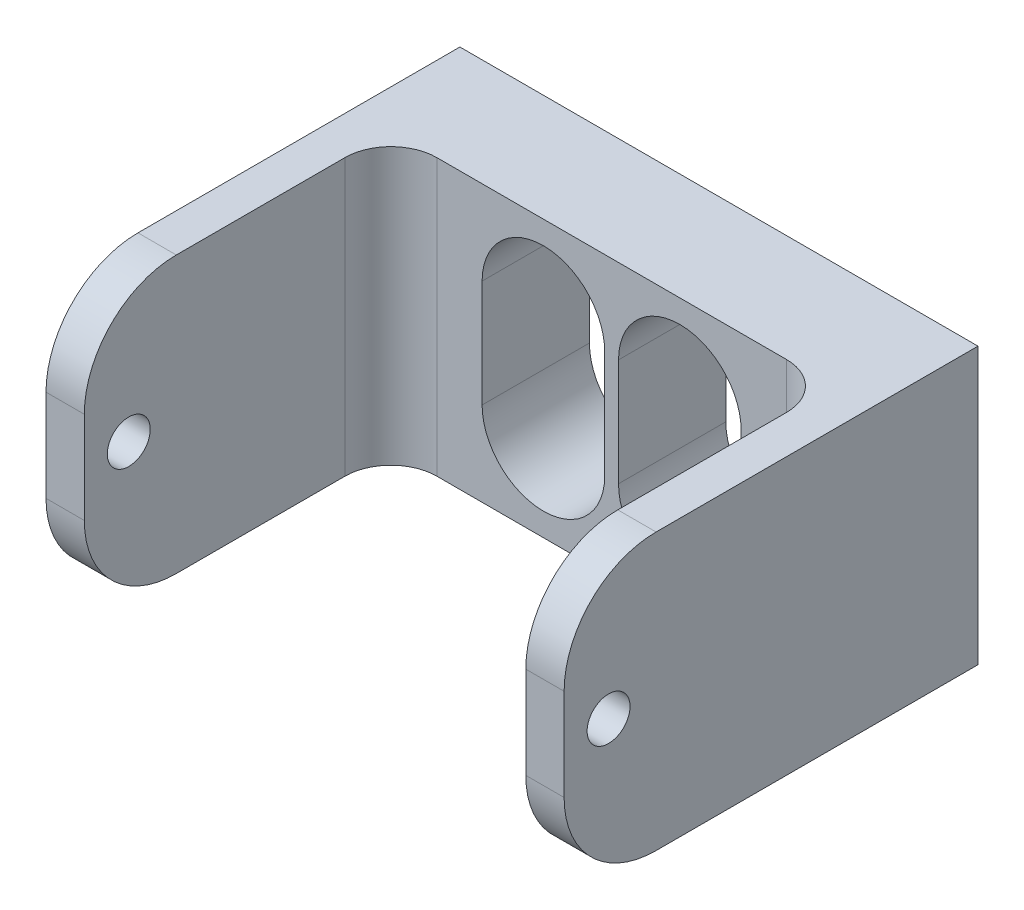
ISO-10303-21;
HEADER;
FILE_DESCRIPTION(('STEP AP214'),'2;1');
FILE_NAME('part.step','',(''),(''),'','','');
FILE_SCHEMA(('AUTOMOTIVE_DESIGN { 1 0 10303 214 1 1 1 1 }'));
ENDSEC;
DATA;
#1=APPLICATION_CONTEXT('core data for automotive mechanical design processes');
#2=APPLICATION_PROTOCOL_DEFINITION('international standard','automotive_design',2000,#1);
#3=PRODUCT_CONTEXT('',#1,'mechanical');
#4=PRODUCT('Part','Part','',(#3));
#5=PRODUCT_RELATED_PRODUCT_CATEGORY('part','',(#4));
#6=PRODUCT_DEFINITION_FORMATION('','',#4);
#7=PRODUCT_DEFINITION_CONTEXT('part definition',#1,'design');
#8=PRODUCT_DEFINITION('design','',#6,#7);
#9=PRODUCT_DEFINITION_SHAPE('','',#8);
#10=(LENGTH_UNIT() NAMED_UNIT(*) SI_UNIT(.MILLI.,.METRE.));
#11=(NAMED_UNIT(*) PLANE_ANGLE_UNIT() SI_UNIT($,.RADIAN.));
#12=(NAMED_UNIT(*) SI_UNIT($,.STERADIAN.) SOLID_ANGLE_UNIT());
#13=UNCERTAINTY_MEASURE_WITH_UNIT(LENGTH_MEASURE(1.E-05),#10,'distance_accuracy_value','');
#14=(GEOMETRIC_REPRESENTATION_CONTEXT(3) GLOBAL_UNCERTAINTY_ASSIGNED_CONTEXT((#13)) GLOBAL_UNIT_ASSIGNED_CONTEXT((#10,
#11,#12)) REPRESENTATION_CONTEXT('',''));
#15=CARTESIAN_POINT('',(0.,0.,0.));
#16=DIRECTION('',(0.,0.,1.));
#17=DIRECTION('',(1.,0.,0.));
#18=AXIS2_PLACEMENT_3D('',#15,#16,#17);
#19=CARTESIAN_POINT('',(0.,0.,7.));
#20=DIRECTION('',(0.,0.,-1.));
#21=DIRECTION('',(-1.,0.,0.));
#22=AXIS2_PLACEMENT_3D('',#19,#20,#21);
#23=PLANE('',#22);
#24=CARTESIAN_POINT('',(-4.45,3.50000000000001,7.));
#25=DIRECTION('',(0.,0.,1.));
#26=DIRECTION('',(1.,0.,0.));
#27=AXIS2_PLACEMENT_3D('',#24,#25,#26);
#28=CIRCLE('',#27,4.);
#29=CARTESIAN_POINT('',(-0.449999999999998,3.50000000000001,7.));
#30=VERTEX_POINT('',#29);
#31=CARTESIAN_POINT('',(-8.45,3.50000000000001,7.));
#32=VERTEX_POINT('',#31);
#33=EDGE_CURVE('E229',#30,#32,#28,.T.);
#34=ORIENTED_EDGE('',*,*,#33,.F.);
#35=DIRECTION('',(0.,1.,0.));
#36=VECTOR('',#35,1.);
#37=CARTESIAN_POINT('',(-0.449999999999998,3.50000000000001,7.));
#38=LINE('',#37,#36);
#39=CARTESIAN_POINT('',(-0.449999999999995,-3.49999999999999,7.));
#40=VERTEX_POINT('',#39);
#41=EDGE_CURVE('E237',#40,#30,#38,.T.);
#42=ORIENTED_EDGE('',*,*,#41,.F.);
#43=CARTESIAN_POINT('',(-4.45,-3.49999999999999,7.));
#44=DIRECTION('',(0.,0.,1.));
#45=DIRECTION('',(1.,0.,0.));
#46=AXIS2_PLACEMENT_3D('',#43,#44,#45);
#47=CIRCLE('',#46,4.);
#48=CARTESIAN_POINT('',(-8.45,-3.49999999999999,7.));
#49=VERTEX_POINT('',#48);
#50=EDGE_CURVE('E234',#49,#40,#47,.T.);
#51=ORIENTED_EDGE('',*,*,#50,.F.);
#52=DIRECTION('',(0.,-1.,0.));
#53=VECTOR('',#52,1.);
#54=CARTESIAN_POINT('',(-8.45,3.50000000000001,7.));
#55=LINE('',#54,#53);
#56=EDGE_CURVE('E231',#32,#49,#55,.T.);
#57=ORIENTED_EDGE('',*,*,#56,.F.);
#58=EDGE_LOOP('',(#34,#42,#51,#57));
#59=FACE_BOUND('',#58,.T.);
#60=CARTESIAN_POINT('',(4.45,3.5,7.));
#61=DIRECTION('',(0.,0.,1.));
#62=DIRECTION('',(1.,0.,0.));
#63=AXIS2_PLACEMENT_3D('',#60,#61,#62);
#64=CIRCLE('',#63,4.);
#65=CARTESIAN_POINT('',(8.45,3.5,7.));
#66=VERTEX_POINT('',#65);
#67=CARTESIAN_POINT('',(0.449999999999999,3.5,7.));
#68=VERTEX_POINT('',#67);
#69=EDGE_CURVE('E185',#66,#68,#64,.T.);
#70=ORIENTED_EDGE('',*,*,#69,.F.);
#71=DIRECTION('',(0.,1.,0.));
#72=VECTOR('',#71,1.);
#73=CARTESIAN_POINT('',(8.45,3.5,7.));
#74=LINE('',#73,#72);
#75=CARTESIAN_POINT('',(8.45,-3.5,7.));
#76=VERTEX_POINT('',#75);
#77=EDGE_CURVE('E211',#76,#66,#74,.T.);
#78=ORIENTED_EDGE('',*,*,#77,.F.);
#79=CARTESIAN_POINT('',(4.45,-3.5,7.));
#80=DIRECTION('',(0.,0.,1.));
#81=DIRECTION('',(1.,0.,0.));
#82=AXIS2_PLACEMENT_3D('',#79,#80,#81);
#83=CIRCLE('',#82,4.);
#84=CARTESIAN_POINT('',(0.45,-3.5,7.));
#85=VERTEX_POINT('',#84);
#86=EDGE_CURVE('E209',#85,#76,#83,.T.);
#87=ORIENTED_EDGE('',*,*,#86,.F.);
#88=DIRECTION('',(0.,-1.,0.));
#89=VECTOR('',#88,1.);
#90=CARTESIAN_POINT('',(0.449999999999999,3.5,7.));
#91=LINE('',#90,#89);
#92=EDGE_CURVE('E195',#68,#85,#91,.T.);
#93=ORIENTED_EDGE('',*,*,#92,.F.);
#94=EDGE_LOOP('',(#70,#78,#87,#93));
#95=FACE_BOUND('',#94,.T.);
#96=DIRECTION('',(1.,0.,0.));
#97=VECTOR('',#96,1.);
#98=CARTESIAN_POINT('',(-16.9,-9.,7.));
#99=LINE('',#98,#97);
#100=CARTESIAN_POINT('',(-11.4,-9.,7.));
#101=VERTEX_POINT('',#100);
#102=CARTESIAN_POINT('',(11.4,-9.,7.));
#103=VERTEX_POINT('',#102);
#104=EDGE_CURVE('E269',#101,#103,#99,.T.);
#105=ORIENTED_EDGE('',*,*,#104,.T.);
#106=DIRECTION('',(0.,-1.,0.));
#107=VECTOR('',#106,1.);
#108=CARTESIAN_POINT('',(11.4,9.,7.));
#109=LINE('',#108,#107);
#110=CARTESIAN_POINT('',(11.4,9.,7.));
#111=VERTEX_POINT('',#110);
#112=EDGE_CURVE('E278',#103,#111,#109,.F.);
#113=ORIENTED_EDGE('',*,*,#112,.T.);
#114=DIRECTION('',(-1.,0.,0.));
#115=VECTOR('',#114,1.);
#116=CARTESIAN_POINT('',(-16.9,9.,7.));
#117=LINE('',#116,#115);
#118=CARTESIAN_POINT('',(-11.4,9.,7.));
#119=VERTEX_POINT('',#118);
#120=EDGE_CURVE('E265',#111,#119,#117,.T.);
#121=ORIENTED_EDGE('',*,*,#120,.T.);
#122=DIRECTION('',(0.,1.,0.));
#123=VECTOR('',#122,1.);
#124=CARTESIAN_POINT('',(-11.4,-9.,7.));
#125=LINE('',#124,#123);
#126=EDGE_CURVE('E276',#119,#101,#125,.F.);
#127=ORIENTED_EDGE('',*,*,#126,.T.);
#128=EDGE_LOOP('',(#105,#113,#121,#127));
#129=FACE_BOUND('',#128,.T.);
#130=ADVANCED_FACE('F35',(#59,#95,#129),#23,.F.);
#131=CARTESIAN_POINT('',(0.,0.,0.));
#132=DIRECTION('',(0.,0.,-1.));
#133=DIRECTION('',(-1.,0.,0.));
#134=AXIS2_PLACEMENT_3D('',#131,#132,#133);
#135=PLANE('',#134);
#136=DIRECTION('',(0.,1.,0.));
#137=VECTOR('',#136,1.);
#138=CARTESIAN_POINT('',(-0.449999999999998,3.50000000000001,0.));
#139=LINE('',#138,#137);
#140=CARTESIAN_POINT('',(-0.449999999999995,-3.49999999999999,0.));
#141=VERTEX_POINT('',#140);
#142=CARTESIAN_POINT('',(-0.449999999999998,3.50000000000001,0.));
#143=VERTEX_POINT('',#142);
#144=EDGE_CURVE('E232',#141,#143,#139,.T.);
#145=ORIENTED_EDGE('',*,*,#144,.T.);
#146=CARTESIAN_POINT('',(-4.45,3.50000000000001,0.));
#147=DIRECTION('',(0.,0.,1.));
#148=DIRECTION('',(1.,0.,0.));
#149=AXIS2_PLACEMENT_3D('',#146,#147,#148);
#150=CIRCLE('',#149,4.);
#151=CARTESIAN_POINT('',(-8.45,3.50000000000001,0.));
#152=VERTEX_POINT('',#151);
#153=EDGE_CURVE('E203',#143,#152,#150,.T.);
#154=ORIENTED_EDGE('',*,*,#153,.T.);
#155=DIRECTION('',(0.,-1.,0.));
#156=VECTOR('',#155,1.);
#157=CARTESIAN_POINT('',(-8.45,3.50000000000001,0.));
#158=LINE('',#157,#156);
#159=CARTESIAN_POINT('',(-8.45,-3.49999999999999,0.));
#160=VERTEX_POINT('',#159);
#161=EDGE_CURVE('E242',#152,#160,#158,.T.);
#162=ORIENTED_EDGE('',*,*,#161,.T.);
#163=CARTESIAN_POINT('',(-4.45,-3.49999999999999,0.));
#164=DIRECTION('',(0.,0.,1.));
#165=DIRECTION('',(1.,0.,0.));
#166=AXIS2_PLACEMENT_3D('',#163,#164,#165);
#167=CIRCLE('',#166,4.);
#168=EDGE_CURVE('E245',#160,#141,#167,.T.);
#169=ORIENTED_EDGE('',*,*,#168,.T.);
#170=EDGE_LOOP('',(#145,#154,#162,#169));
#171=FACE_BOUND('',#170,.T.);
#172=DIRECTION('',(0.,1.,0.));
#173=VECTOR('',#172,1.);
#174=CARTESIAN_POINT('',(16.9,-9.,0.));
#175=LINE('',#174,#173);
#176=CARTESIAN_POINT('',(16.9,-9.,0.));
#177=VERTEX_POINT('',#176);
#178=CARTESIAN_POINT('',(16.9,9.,0.));
#179=VERTEX_POINT('',#178);
#180=EDGE_CURVE('E259',#177,#179,#175,.T.);
#181=ORIENTED_EDGE('',*,*,#180,.F.);
#182=DIRECTION('',(1.,0.,0.));
#183=VECTOR('',#182,1.);
#184=CARTESIAN_POINT('',(-16.9,-9.,0.));
#185=LINE('',#184,#183);
#186=CARTESIAN_POINT('',(-16.9,-9.,0.));
#187=VERTEX_POINT('',#186);
#188=EDGE_CURVE('E270',#187,#177,#185,.T.);
#189=ORIENTED_EDGE('',*,*,#188,.F.);
#190=DIRECTION('',(0.,-1.,0.));
#191=VECTOR('',#190,1.);
#192=CARTESIAN_POINT('',(-16.9,-9.,0.));
#193=LINE('',#192,#191);
#194=CARTESIAN_POINT('',(-16.9,9.,0.));
#195=VERTEX_POINT('',#194);
#196=EDGE_CURVE('E403',#195,#187,#193,.T.);
#197=ORIENTED_EDGE('',*,*,#196,.F.);
#198=DIRECTION('',(-1.,0.,0.));
#199=VECTOR('',#198,1.);
#200=CARTESIAN_POINT('',(-16.9,9.,0.));
#201=LINE('',#200,#199);
#202=EDGE_CURVE('E394',#179,#195,#201,.T.);
#203=ORIENTED_EDGE('',*,*,#202,.F.);
#204=EDGE_LOOP('',(#181,#189,#197,#203));
#205=FACE_BOUND('',#204,.T.);
#206=DIRECTION('',(0.,1.,0.));
#207=VECTOR('',#206,1.);
#208=CARTESIAN_POINT('',(8.45,3.5,0.));
#209=LINE('',#208,#207);
#210=CARTESIAN_POINT('',(8.45,-3.5,0.));
#211=VERTEX_POINT('',#210);
#212=CARTESIAN_POINT('',(8.45,3.5,0.));
#213=VERTEX_POINT('',#212);
#214=EDGE_CURVE('E196',#211,#213,#209,.T.);
#215=ORIENTED_EDGE('',*,*,#214,.T.);
#216=CARTESIAN_POINT('',(4.45,3.5,0.));
#217=DIRECTION('',(0.,0.,1.));
#218=DIRECTION('',(1.,0.,0.));
#219=AXIS2_PLACEMENT_3D('',#216,#217,#218);
#220=CIRCLE('',#219,4.);
#221=CARTESIAN_POINT('',(0.449999999999999,3.5,0.));
#222=VERTEX_POINT('',#221);
#223=EDGE_CURVE('E216',#213,#222,#220,.T.);
#224=ORIENTED_EDGE('',*,*,#223,.T.);
#225=DIRECTION('',(0.,-1.,0.));
#226=VECTOR('',#225,1.);
#227=CARTESIAN_POINT('',(0.449999999999999,3.5,0.));
#228=LINE('',#227,#226);
#229=CARTESIAN_POINT('',(0.45,-3.5,0.));
#230=VERTEX_POINT('',#229);
#231=EDGE_CURVE('E202',#222,#230,#228,.T.);
#232=ORIENTED_EDGE('',*,*,#231,.T.);
#233=CARTESIAN_POINT('',(4.45,-3.5,0.));
#234=DIRECTION('',(0.,0.,1.));
#235=DIRECTION('',(1.,0.,0.));
#236=AXIS2_PLACEMENT_3D('',#233,#234,#235);
#237=CIRCLE('',#236,4.);
#238=EDGE_CURVE('E220',#230,#211,#237,.T.);
#239=ORIENTED_EDGE('',*,*,#238,.T.);
#240=EDGE_LOOP('',(#215,#224,#232,#239));
#241=FACE_BOUND('',#240,.T.);
#242=ADVANCED_FACE('F410',(#171,#205,#241),#135,.T.);
#243=CARTESIAN_POINT('',(16.9,-9.,7.));
#244=DIRECTION('',(-1.,0.,0.));
#245=DIRECTION('',(0.,0.,1.));
#246=AXIS2_PLACEMENT_3D('',#243,#244,#245);
#247=PLANE('',#246);
#248=CARTESIAN_POINT('',(16.9,0.,24.1));
#249=DIRECTION('',(1.,0.,0.));
#250=DIRECTION('',(0.,0.,-1.));
#251=AXIS2_PLACEMENT_3D('',#248,#249,#250);
#252=CIRCLE('',#251,1.4);
#253=CARTESIAN_POINT('',(16.9,0.,22.7));
#254=VERTEX_POINT('',#253);
#255=EDGE_CURVE('E453',#254,#254,#252,.T.);
#256=ORIENTED_EDGE('',*,*,#255,.F.);
#257=EDGE_LOOP('',(#256));
#258=FACE_BOUND('',#257,.T.);
#259=DIRECTION('',(0.,1.,0.));
#260=VECTOR('',#259,1.);
#261=CARTESIAN_POINT('',(16.9,9.,27.));
#262=LINE('',#261,#260);
#263=CARTESIAN_POINT('',(16.9,-3.,27.));
#264=VERTEX_POINT('',#263);
#265=CARTESIAN_POINT('',(16.9,3.,27.));
#266=VERTEX_POINT('',#265);
#267=EDGE_CURVE('E375',#264,#266,#262,.T.);
#268=ORIENTED_EDGE('',*,*,#267,.F.);
#269=CARTESIAN_POINT('',(16.9,-3.,21.));
#270=DIRECTION('',(-1.,0.,0.));
#271=DIRECTION('',(0.,0.,1.));
#272=AXIS2_PLACEMENT_3D('',#269,#270,#271);
#273=CIRCLE('',#272,6.);
#274=CARTESIAN_POINT('',(16.9,-9.,21.));
#275=VERTEX_POINT('',#274);
#276=EDGE_CURVE('E306',#264,#275,#273,.F.);
#277=ORIENTED_EDGE('',*,*,#276,.T.);
#278=DIRECTION('',(0.,0.,-1.));
#279=VECTOR('',#278,1.);
#280=CARTESIAN_POINT('',(16.9,-9.,7.));
#281=LINE('',#280,#279);
#282=EDGE_CURVE('E275',#275,#177,#281,.T.);
#283=ORIENTED_EDGE('',*,*,#282,.T.);
#284=ORIENTED_EDGE('',*,*,#180,.T.);
#285=DIRECTION('',(0.,0.,-1.));
#286=VECTOR('',#285,1.);
#287=CARTESIAN_POINT('',(16.9,9.,7.));
#288=LINE('',#287,#286);
#289=CARTESIAN_POINT('',(16.9,9.,21.));
#290=VERTEX_POINT('',#289);
#291=EDGE_CURVE('E324',#290,#179,#288,.T.);
#292=ORIENTED_EDGE('',*,*,#291,.F.);
#293=CARTESIAN_POINT('',(16.9,3.,21.));
#294=DIRECTION('',(-1.,0.,0.));
#295=DIRECTION('',(0.,0.,1.));
#296=AXIS2_PLACEMENT_3D('',#293,#294,#295);
#297=CIRCLE('',#296,6.);
#298=EDGE_CURVE('E326',#290,#266,#297,.F.);
#299=ORIENTED_EDGE('',*,*,#298,.T.);
#300=EDGE_LOOP('',(#268,#277,#283,#284,#292,#299));
#301=FACE_BOUND('',#300,.T.);
#302=ADVANCED_FACE('F407',(#258,#301),#247,.F.);
#303=CARTESIAN_POINT('',(-16.9,9.,7.));
#304=DIRECTION('',(0.,-1.,0.));
#305=DIRECTION('',(0.,0.,-1.));
#306=AXIS2_PLACEMENT_3D('',#303,#304,#305);
#307=PLANE('',#306);
#308=DIRECTION('',(0.,0.,-1.));
#309=VECTOR('',#308,1.);
#310=CARTESIAN_POINT('',(-16.9,9.,7.));
#311=LINE('',#310,#309);
#312=CARTESIAN_POINT('',(-16.9,9.,21.));
#313=VERTEX_POINT('',#312);
#314=EDGE_CURVE('E391',#313,#195,#311,.T.);
#315=ORIENTED_EDGE('',*,*,#314,.F.);
#316=DIRECTION('',(-1.,0.,0.));
#317=VECTOR('',#316,1.);
#318=CARTESIAN_POINT('',(-14.4,9.,21.));
#319=LINE('',#318,#317);
#320=CARTESIAN_POINT('',(-14.4,9.,21.));
#321=VERTEX_POINT('',#320);
#322=EDGE_CURVE('E357',#313,#321,#319,.F.);
#323=ORIENTED_EDGE('',*,*,#322,.T.);
#324=DIRECTION('',(0.,0.,-1.));
#325=VECTOR('',#324,1.);
#326=CARTESIAN_POINT('',(-14.4,9.,27.));
#327=LINE('',#326,#325);
#328=CARTESIAN_POINT('',(-14.4,9.,10.));
#329=VERTEX_POINT('',#328);
#330=EDGE_CURVE('E292',#321,#329,#327,.T.);
#331=ORIENTED_EDGE('',*,*,#330,.T.);
#332=CARTESIAN_POINT('',(-11.4,9.,10.));
#333=DIRECTION('',(0.,-1.,0.));
#334=DIRECTION('',(0.,0.,-1.));
#335=AXIS2_PLACEMENT_3D('',#332,#333,#334);
#336=CIRCLE('',#335,3.);
#337=EDGE_CURVE('E43',#329,#119,#336,.T.);
#338=ORIENTED_EDGE('',*,*,#337,.T.);
#339=ORIENTED_EDGE('',*,*,#120,.F.);
#340=CARTESIAN_POINT('',(11.4,9.,10.));
#341=DIRECTION('',(0.,-1.,0.));
#342=DIRECTION('',(0.,0.,-1.));
#343=AXIS2_PLACEMENT_3D('',#340,#341,#342);
#344=CIRCLE('',#343,3.);
#345=CARTESIAN_POINT('',(14.4,9.,10.));
#346=VERTEX_POINT('',#345);
#347=EDGE_CURVE('E284',#111,#346,#344,.T.);
#348=ORIENTED_EDGE('',*,*,#347,.T.);
#349=DIRECTION('',(0.,0.,-1.));
#350=VECTOR('',#349,1.);
#351=CARTESIAN_POINT('',(14.4,9.,27.));
#352=LINE('',#351,#350);
#353=CARTESIAN_POINT('',(14.4,9.,21.));
#354=VERTEX_POINT('',#353);
#355=EDGE_CURVE('E367',#354,#346,#352,.T.);
#356=ORIENTED_EDGE('',*,*,#355,.F.);
#357=DIRECTION('',(-1.,0.,0.));
#358=VECTOR('',#357,1.);
#359=CARTESIAN_POINT('',(-16.9,9.,21.));
#360=LINE('',#359,#358);
#361=EDGE_CURVE('E356',#354,#290,#360,.F.);
#362=ORIENTED_EDGE('',*,*,#361,.T.);
#363=ORIENTED_EDGE('',*,*,#291,.T.);
#364=ORIENTED_EDGE('',*,*,#202,.T.);
#365=EDGE_LOOP('',(#315,#323,#331,#338,#339,#348,#356,#362,#363,#364));
#366=FACE_BOUND('',#365,.T.);
#367=ADVANCED_FACE('F289',(#366),#307,.F.);
#368=CARTESIAN_POINT('',(-16.9,-9.,7.));
#369=DIRECTION('',(1.,0.,0.));
#370=DIRECTION('',(0.,0.,-1.));
#371=AXIS2_PLACEMENT_3D('',#368,#369,#370);
#372=PLANE('',#371);
#373=CARTESIAN_POINT('',(-16.9,0.,24.1));
#374=DIRECTION('',(1.,0.,0.));
#375=DIRECTION('',(0.,0.,-1.));
#376=AXIS2_PLACEMENT_3D('',#373,#374,#375);
#377=CIRCLE('',#376,1.4);
#378=CARTESIAN_POINT('',(-16.9,0.,22.7));
#379=VERTEX_POINT('',#378);
#380=EDGE_CURVE('E319',#379,#379,#377,.T.);
#381=ORIENTED_EDGE('',*,*,#380,.T.);
#382=EDGE_LOOP('',(#381));
#383=FACE_BOUND('',#382,.T.);
#384=DIRECTION('',(0.,0.,-1.));
#385=VECTOR('',#384,1.);
#386=CARTESIAN_POINT('',(-16.9,-9.,7.));
#387=LINE('',#386,#385);
#388=CARTESIAN_POINT('',(-16.9,-9.,21.));
#389=VERTEX_POINT('',#388);
#390=EDGE_CURVE('E396',#389,#187,#387,.T.);
#391=ORIENTED_EDGE('',*,*,#390,.F.);
#392=CARTESIAN_POINT('',(-16.9,-3.,21.));
#393=DIRECTION('',(1.,0.,0.));
#394=DIRECTION('',(0.,0.,-1.));
#395=AXIS2_PLACEMENT_3D('',#392,#393,#394);
#396=CIRCLE('',#395,6.);
#397=CARTESIAN_POINT('',(-16.9,-3.,27.));
#398=VERTEX_POINT('',#397);
#399=EDGE_CURVE('E354',#389,#398,#396,.F.);
#400=ORIENTED_EDGE('',*,*,#399,.T.);
#401=DIRECTION('',(0.,-1.,0.));
#402=VECTOR('',#401,1.);
#403=CARTESIAN_POINT('',(-16.9,9.,27.));
#404=LINE('',#403,#402);
#405=CARTESIAN_POINT('',(-16.9,3.,27.));
#406=VERTEX_POINT('',#405);
#407=EDGE_CURVE('E372',#406,#398,#404,.T.);
#408=ORIENTED_EDGE('',*,*,#407,.F.);
#409=CARTESIAN_POINT('',(-16.9,3.,21.));
#410=DIRECTION('',(1.,0.,0.));
#411=DIRECTION('',(0.,0.,-1.));
#412=AXIS2_PLACEMENT_3D('',#409,#410,#411);
#413=CIRCLE('',#412,6.);
#414=EDGE_CURVE('E352',#406,#313,#413,.F.);
#415=ORIENTED_EDGE('',*,*,#414,.T.);
#416=ORIENTED_EDGE('',*,*,#314,.T.);
#417=ORIENTED_EDGE('',*,*,#196,.T.);
#418=EDGE_LOOP('',(#391,#400,#408,#415,#416,#417));
#419=FACE_BOUND('',#418,.T.);
#420=ADVANCED_FACE('F389',(#383,#419),#372,.F.);
#421=CARTESIAN_POINT('',(-16.9,-9.,7.));
#422=DIRECTION('',(0.,1.,0.));
#423=DIRECTION('',(0.,0.,1.));
#424=AXIS2_PLACEMENT_3D('',#421,#422,#423);
#425=PLANE('',#424);
#426=ORIENTED_EDGE('',*,*,#282,.F.);
#427=DIRECTION('',(1.,0.,0.));
#428=VECTOR('',#427,1.);
#429=CARTESIAN_POINT('',(-16.9,-9.,21.));
#430=LINE('',#429,#428);
#431=CARTESIAN_POINT('',(14.4,-9.,21.));
#432=VERTEX_POINT('',#431);
#433=EDGE_CURVE('E333',#275,#432,#430,.F.);
#434=ORIENTED_EDGE('',*,*,#433,.T.);
#435=DIRECTION('',(0.,0.,-1.));
#436=VECTOR('',#435,1.);
#437=CARTESIAN_POINT('',(14.4,-9.,27.));
#438=LINE('',#437,#436);
#439=CARTESIAN_POINT('',(14.4,-9.,10.));
#440=VERTEX_POINT('',#439);
#441=EDGE_CURVE('E364',#432,#440,#438,.T.);
#442=ORIENTED_EDGE('',*,*,#441,.T.);
#443=CARTESIAN_POINT('',(11.4,-9.,10.));
#444=DIRECTION('',(0.,1.,0.));
#445=DIRECTION('',(0.,0.,1.));
#446=AXIS2_PLACEMENT_3D('',#443,#444,#445);
#447=CIRCLE('',#446,3.);
#448=EDGE_CURVE('E282',#440,#103,#447,.T.);
#449=ORIENTED_EDGE('',*,*,#448,.T.);
#450=ORIENTED_EDGE('',*,*,#104,.F.);
#451=CARTESIAN_POINT('',(-11.4,-9.,10.));
#452=DIRECTION('',(0.,1.,0.));
#453=DIRECTION('',(0.,0.,1.));
#454=AXIS2_PLACEMENT_3D('',#451,#452,#453);
#455=CIRCLE('',#454,3.);
#456=CARTESIAN_POINT('',(-14.4,-9.,10.));
#457=VERTEX_POINT('',#456);
#458=EDGE_CURVE('E11',#101,#457,#455,.T.);
#459=ORIENTED_EDGE('',*,*,#458,.T.);
#460=DIRECTION('',(0.,0.,-1.));
#461=VECTOR('',#460,1.);
#462=CARTESIAN_POINT('',(-14.4,-9.,27.));
#463=LINE('',#462,#461);
#464=CARTESIAN_POINT('',(-14.4,-9.,21.));
#465=VERTEX_POINT('',#464);
#466=EDGE_CURVE('E218',#465,#457,#463,.T.);
#467=ORIENTED_EDGE('',*,*,#466,.F.);
#468=DIRECTION('',(1.,0.,0.));
#469=VECTOR('',#468,1.);
#470=CARTESIAN_POINT('',(-16.9,-9.,21.));
#471=LINE('',#470,#469);
#472=EDGE_CURVE('E308',#465,#389,#471,.F.);
#473=ORIENTED_EDGE('',*,*,#472,.T.);
#474=ORIENTED_EDGE('',*,*,#390,.T.);
#475=ORIENTED_EDGE('',*,*,#188,.T.);
#476=EDGE_LOOP('',(#426,#434,#442,#449,#450,#459,#467,#473,#474,#475));
#477=FACE_BOUND('',#476,.T.);
#478=ADVANCED_FACE('F369',(#477),#425,.F.);
#479=CARTESIAN_POINT('',(-4.45,3.50000000000001,7.));
#480=DIRECTION('',(0.,0.,-1.));
#481=DIRECTION('',(-1.,0.,0.));
#482=AXIS2_PLACEMENT_3D('',#479,#480,#481);
#483=CYLINDRICAL_SURFACE('',#482,4.);
#484=ORIENTED_EDGE('',*,*,#153,.F.);
#485=DIRECTION('',(0.,0.,-1.));
#486=VECTOR('',#485,1.);
#487=CARTESIAN_POINT('',(-0.449999999999998,3.50000000000001,7.));
#488=LINE('',#487,#486);
#489=EDGE_CURVE('E239',#30,#143,#488,.T.);
#490=ORIENTED_EDGE('',*,*,#489,.F.);
#491=ORIENTED_EDGE('',*,*,#33,.T.);
#492=DIRECTION('',(0.,0.,-1.));
#493=VECTOR('',#492,1.);
#494=CARTESIAN_POINT('',(-8.45,3.50000000000001,7.));
#495=LINE('',#494,#493);
#496=EDGE_CURVE('E256',#32,#152,#495,.T.);
#497=ORIENTED_EDGE('',*,*,#496,.T.);
#498=EDGE_LOOP('',(#484,#490,#491,#497));
#499=FACE_BOUND('',#498,.T.);
#500=ADVANCED_FACE('F437',(#499),#483,.F.);
#501=CARTESIAN_POINT('',(-8.45,3.50000000000001,7.));
#502=DIRECTION('',(1.,0.,0.));
#503=DIRECTION('',(0.,1.,0.));
#504=AXIS2_PLACEMENT_3D('',#501,#502,#503);
#505=PLANE('',#504);
#506=ORIENTED_EDGE('',*,*,#161,.F.);
#507=ORIENTED_EDGE('',*,*,#496,.F.);
#508=ORIENTED_EDGE('',*,*,#56,.T.);
#509=DIRECTION('',(0.,0.,-1.));
#510=VECTOR('',#509,1.);
#511=CARTESIAN_POINT('',(-8.45,-3.49999999999999,7.));
#512=LINE('',#511,#510);
#513=EDGE_CURVE('E254',#49,#160,#512,.T.);
#514=ORIENTED_EDGE('',*,*,#513,.T.);
#515=EDGE_LOOP('',(#506,#507,#508,#514));
#516=FACE_BOUND('',#515,.T.);
#517=ADVANCED_FACE('F599',(#516),#505,.T.);
#518=CARTESIAN_POINT('',(-4.45,-3.49999999999999,7.));
#519=DIRECTION('',(0.,0.,-1.));
#520=DIRECTION('',(-1.,0.,0.));
#521=AXIS2_PLACEMENT_3D('',#518,#519,#520);
#522=CYLINDRICAL_SURFACE('',#521,4.);
#523=ORIENTED_EDGE('',*,*,#168,.F.);
#524=ORIENTED_EDGE('',*,*,#513,.F.);
#525=ORIENTED_EDGE('',*,*,#50,.T.);
#526=DIRECTION('',(0.,0.,-1.));
#527=VECTOR('',#526,1.);
#528=CARTESIAN_POINT('',(-0.449999999999995,-3.49999999999999,7.));
#529=LINE('',#528,#527);
#530=EDGE_CURVE('E252',#40,#141,#529,.T.);
#531=ORIENTED_EDGE('',*,*,#530,.T.);
#532=EDGE_LOOP('',(#523,#524,#525,#531));
#533=FACE_BOUND('',#532,.T.);
#534=ADVANCED_FACE('F589',(#533),#522,.F.);
#535=CARTESIAN_POINT('',(-0.449999999999998,3.50000000000001,7.));
#536=DIRECTION('',(-1.,0.,0.));
#537=DIRECTION('',(0.,-1.,0.));
#538=AXIS2_PLACEMENT_3D('',#535,#536,#537);
#539=PLANE('',#538);
#540=ORIENTED_EDGE('',*,*,#144,.F.);
#541=ORIENTED_EDGE('',*,*,#530,.F.);
#542=ORIENTED_EDGE('',*,*,#41,.T.);
#543=ORIENTED_EDGE('',*,*,#489,.T.);
#544=EDGE_LOOP('',(#540,#541,#542,#543));
#545=FACE_BOUND('',#544,.T.);
#546=ADVANCED_FACE('F580',(#545),#539,.T.);
#547=CARTESIAN_POINT('',(4.45,3.5,7.));
#548=DIRECTION('',(0.,0.,-1.));
#549=DIRECTION('',(-1.,0.,0.));
#550=AXIS2_PLACEMENT_3D('',#547,#548,#549);
#551=CYLINDRICAL_SURFACE('',#550,4.);
#552=ORIENTED_EDGE('',*,*,#223,.F.);
#553=DIRECTION('',(0.,0.,-1.));
#554=VECTOR('',#553,1.);
#555=CARTESIAN_POINT('',(8.45,3.5,7.));
#556=LINE('',#555,#554);
#557=EDGE_CURVE('E191',#66,#213,#556,.T.);
#558=ORIENTED_EDGE('',*,*,#557,.F.);
#559=ORIENTED_EDGE('',*,*,#69,.T.);
#560=DIRECTION('',(0.,0.,-1.));
#561=VECTOR('',#560,1.);
#562=CARTESIAN_POINT('',(0.449999999999999,3.5,7.));
#563=LINE('',#562,#561);
#564=EDGE_CURVE('E188',#68,#222,#563,.T.);
#565=ORIENTED_EDGE('',*,*,#564,.T.);
#566=EDGE_LOOP('',(#552,#558,#559,#565));
#567=FACE_BOUND('',#566,.T.);
#568=ADVANCED_FACE('F187',(#567),#551,.F.);
#569=CARTESIAN_POINT('',(0.449999999999999,3.5,7.));
#570=DIRECTION('',(1.,0.,0.));
#571=DIRECTION('',(0.,0.,-1.));
#572=AXIS2_PLACEMENT_3D('',#569,#570,#571);
#573=PLANE('',#572);
#574=ORIENTED_EDGE('',*,*,#231,.F.);
#575=ORIENTED_EDGE('',*,*,#564,.F.);
#576=ORIENTED_EDGE('',*,*,#92,.T.);
#577=DIRECTION('',(0.,0.,-1.));
#578=VECTOR('',#577,1.);
#579=CARTESIAN_POINT('',(0.45,-3.5,7.));
#580=LINE('',#579,#578);
#581=EDGE_CURVE('E204',#85,#230,#580,.T.);
#582=ORIENTED_EDGE('',*,*,#581,.T.);
#583=EDGE_LOOP('',(#574,#575,#576,#582));
#584=FACE_BOUND('',#583,.T.);
#585=ADVANCED_FACE('F199',(#584),#573,.T.);
#586=CARTESIAN_POINT('',(4.45,-3.5,7.));
#587=DIRECTION('',(0.,0.,-1.));
#588=DIRECTION('',(-1.,0.,0.));
#589=AXIS2_PLACEMENT_3D('',#586,#587,#588);
#590=CYLINDRICAL_SURFACE('',#589,4.);
#591=ORIENTED_EDGE('',*,*,#238,.F.);
#592=ORIENTED_EDGE('',*,*,#581,.F.);
#593=ORIENTED_EDGE('',*,*,#86,.T.);
#594=DIRECTION('',(0.,0.,-1.));
#595=VECTOR('',#594,1.);
#596=CARTESIAN_POINT('',(8.45,-3.5,7.));
#597=LINE('',#596,#595);
#598=EDGE_CURVE('E226',#76,#211,#597,.T.);
#599=ORIENTED_EDGE('',*,*,#598,.T.);
#600=EDGE_LOOP('',(#591,#592,#593,#599));
#601=FACE_BOUND('',#600,.T.);
#602=ADVANCED_FACE('F553',(#601),#590,.F.);
#603=CARTESIAN_POINT('',(8.45,3.5,7.));
#604=DIRECTION('',(-1.,0.,0.));
#605=DIRECTION('',(0.,0.,1.));
#606=AXIS2_PLACEMENT_3D('',#603,#604,#605);
#607=PLANE('',#606);
#608=ORIENTED_EDGE('',*,*,#214,.F.);
#609=ORIENTED_EDGE('',*,*,#598,.F.);
#610=ORIENTED_EDGE('',*,*,#77,.T.);
#611=ORIENTED_EDGE('',*,*,#557,.T.);
#612=EDGE_LOOP('',(#608,#609,#610,#611));
#613=FACE_BOUND('',#612,.T.);
#614=ADVANCED_FACE('F548',(#613),#607,.T.);
#615=CARTESIAN_POINT('',(-14.4,9.,27.));
#616=DIRECTION('',(-1.,0.,0.));
#617=DIRECTION('',(0.,-1.,0.));
#618=AXIS2_PLACEMENT_3D('',#615,#616,#617);
#619=PLANE('',#618);
#620=CARTESIAN_POINT('',(-14.4,0.,24.1));
#621=DIRECTION('',(-1.,0.,0.));
#622=DIRECTION('',(0.,-1.,0.));
#623=AXIS2_PLACEMENT_3D('',#620,#621,#622);
#624=CIRCLE('',#623,1.4);
#625=CARTESIAN_POINT('',(-14.4,-1.4,24.1));
#626=VERTEX_POINT('',#625);
#627=EDGE_CURVE('E318',#626,#626,#624,.T.);
#628=ORIENTED_EDGE('',*,*,#627,.T.);
#629=EDGE_LOOP('',(#628));
#630=FACE_BOUND('',#629,.T.);
#631=ORIENTED_EDGE('',*,*,#466,.T.);
#632=DIRECTION('',(0.,1.,0.));
#633=VECTOR('',#632,1.);
#634=CARTESIAN_POINT('',(-14.4,9.,10.));
#635=LINE('',#634,#633);
#636=EDGE_CURVE('E280',#457,#329,#635,.T.);
#637=ORIENTED_EDGE('',*,*,#636,.T.);
#638=ORIENTED_EDGE('',*,*,#330,.F.);
#639=CARTESIAN_POINT('',(-14.4,3.,21.));
#640=DIRECTION('',(-1.,0.,0.));
#641=DIRECTION('',(0.,-1.,0.));
#642=AXIS2_PLACEMENT_3D('',#639,#640,#641);
#643=CIRCLE('',#642,6.);
#644=CARTESIAN_POINT('',(-14.4,3.,27.));
#645=VERTEX_POINT('',#644);
#646=EDGE_CURVE('E348',#321,#645,#643,.F.);
#647=ORIENTED_EDGE('',*,*,#646,.T.);
#648=DIRECTION('',(0.,1.,0.));
#649=VECTOR('',#648,1.);
#650=CARTESIAN_POINT('',(-14.4,9.,27.));
#651=LINE('',#650,#649);
#652=CARTESIAN_POINT('',(-14.4,-3.,27.));
#653=VERTEX_POINT('',#652);
#654=EDGE_CURVE('E301',#653,#645,#651,.T.);
#655=ORIENTED_EDGE('',*,*,#654,.F.);
#656=CARTESIAN_POINT('',(-14.4,-3.,21.));
#657=DIRECTION('',(-1.,0.,0.));
#658=DIRECTION('',(0.,-1.,0.));
#659=AXIS2_PLACEMENT_3D('',#656,#657,#658);
#660=CIRCLE('',#659,6.);
#661=EDGE_CURVE('E298',#653,#465,#660,.F.);
#662=ORIENTED_EDGE('',*,*,#661,.T.);
#663=EDGE_LOOP('',(#631,#637,#638,#647,#655,#662));
#664=FACE_BOUND('',#663,.T.);
#665=ADVANCED_FACE('F295',(#630,#664),#619,.F.);
#666=CARTESIAN_POINT('',(0.,0.,27.));
#667=DIRECTION('',(0.,0.,1.));
#668=DIRECTION('',(1.,0.,0.));
#669=AXIS2_PLACEMENT_3D('',#666,#667,#668);
#670=PLANE('',#669);
#671=ORIENTED_EDGE('',*,*,#407,.T.);
#672=DIRECTION('',(1.,0.,0.));
#673=VECTOR('',#672,1.);
#674=CARTESIAN_POINT('',(-14.4,-3.,27.));
#675=LINE('',#674,#673);
#676=EDGE_CURVE('E346',#398,#653,#675,.T.);
#677=ORIENTED_EDGE('',*,*,#676,.T.);
#678=ORIENTED_EDGE('',*,*,#654,.T.);
#679=DIRECTION('',(-1.,0.,0.));
#680=VECTOR('',#679,1.);
#681=CARTESIAN_POINT('',(-16.9,3.,27.));
#682=LINE('',#681,#680);
#683=EDGE_CURVE('E343',#645,#406,#682,.T.);
#684=ORIENTED_EDGE('',*,*,#683,.T.);
#685=EDGE_LOOP('',(#671,#677,#678,#684));
#686=FACE_BOUND('',#685,.T.);
#687=ADVANCED_FACE('F383',(#686),#670,.T.);
#688=CARTESIAN_POINT('',(14.4,9.,27.));
#689=DIRECTION('',(1.,0.,0.));
#690=DIRECTION('',(0.,1.,0.));
#691=AXIS2_PLACEMENT_3D('',#688,#689,#690);
#692=PLANE('',#691);
#693=CARTESIAN_POINT('',(14.4,0.,24.1));
#694=DIRECTION('',(1.,0.,0.));
#695=DIRECTION('',(0.,1.,0.));
#696=AXIS2_PLACEMENT_3D('',#693,#694,#695);
#697=CIRCLE('',#696,1.4);
#698=CARTESIAN_POINT('',(14.4,1.4,24.1));
#699=VERTEX_POINT('',#698);
#700=EDGE_CURVE('E315',#699,#699,#697,.T.);
#701=ORIENTED_EDGE('',*,*,#700,.T.);
#702=EDGE_LOOP('',(#701));
#703=FACE_BOUND('',#702,.T.);
#704=ORIENTED_EDGE('',*,*,#355,.T.);
#705=DIRECTION('',(0.,-1.,0.));
#706=VECTOR('',#705,1.);
#707=CARTESIAN_POINT('',(14.4,-9.,10.));
#708=LINE('',#707,#706);
#709=EDGE_CURVE('E271',#346,#440,#708,.T.);
#710=ORIENTED_EDGE('',*,*,#709,.T.);
#711=ORIENTED_EDGE('',*,*,#441,.F.);
#712=CARTESIAN_POINT('',(14.4,-3.,21.));
#713=DIRECTION('',(1.,0.,0.));
#714=DIRECTION('',(0.,1.,0.));
#715=AXIS2_PLACEMENT_3D('',#712,#713,#714);
#716=CIRCLE('',#715,6.);
#717=CARTESIAN_POINT('',(14.4,-3.,27.));
#718=VERTEX_POINT('',#717);
#719=EDGE_CURVE('E339',#432,#718,#716,.F.);
#720=ORIENTED_EDGE('',*,*,#719,.T.);
#721=DIRECTION('',(0.,-1.,0.));
#722=VECTOR('',#721,1.);
#723=CARTESIAN_POINT('',(14.4,9.,27.));
#724=LINE('',#723,#722);
#725=CARTESIAN_POINT('',(14.4,3.,27.));
#726=VERTEX_POINT('',#725);
#727=EDGE_CURVE('E370',#726,#718,#724,.T.);
#728=ORIENTED_EDGE('',*,*,#727,.F.);
#729=CARTESIAN_POINT('',(14.4,3.,21.));
#730=DIRECTION('',(1.,0.,0.));
#731=DIRECTION('',(0.,1.,0.));
#732=AXIS2_PLACEMENT_3D('',#729,#730,#731);
#733=CIRCLE('',#732,6.);
#734=EDGE_CURVE('E335',#726,#354,#733,.F.);
#735=ORIENTED_EDGE('',*,*,#734,.T.);
#736=EDGE_LOOP('',(#704,#710,#711,#720,#728,#735));
#737=FACE_BOUND('',#736,.T.);
#738=ADVANCED_FACE('F363',(#703,#737),#692,.F.);
#739=CARTESIAN_POINT('',(0.,0.,27.));
#740=DIRECTION('',(0.,0.,-1.));
#741=DIRECTION('',(-1.,0.,0.));
#742=AXIS2_PLACEMENT_3D('',#739,#740,#741);
#743=PLANE('',#742);
#744=ORIENTED_EDGE('',*,*,#727,.T.);
#745=DIRECTION('',(1.,0.,0.));
#746=VECTOR('',#745,1.);
#747=CARTESIAN_POINT('',(0.,-3.,27.));
#748=LINE('',#747,#746);
#749=EDGE_CURVE('E323',#718,#264,#748,.T.);
#750=ORIENTED_EDGE('',*,*,#749,.T.);
#751=ORIENTED_EDGE('',*,*,#267,.T.);
#752=DIRECTION('',(-1.,0.,0.));
#753=VECTOR('',#752,1.);
#754=CARTESIAN_POINT('',(0.,3.,27.));
#755=LINE('',#754,#753);
#756=EDGE_CURVE('E320',#266,#726,#755,.T.);
#757=ORIENTED_EDGE('',*,*,#756,.T.);
#758=EDGE_LOOP('',(#744,#750,#751,#757));
#759=FACE_BOUND('',#758,.T.);
#760=ADVANCED_FACE('F462',(#759),#743,.F.);
#761=CARTESIAN_POINT('',(-16.9,0.,24.1));
#762=DIRECTION('',(1.,0.,0.));
#763=DIRECTION('',(0.,0.,-1.));
#764=AXIS2_PLACEMENT_3D('',#761,#762,#763);
#765=CYLINDRICAL_SURFACE('',#764,1.4);
#766=ORIENTED_EDGE('',*,*,#255,.T.);
#767=EDGE_LOOP('',(#766));
#768=FACE_BOUND('',#767,.T.);
#769=ORIENTED_EDGE('',*,*,#700,.F.);
#770=EDGE_LOOP('',(#769));
#771=FACE_BOUND('',#770,.T.);
#772=ADVANCED_FACE('F501',(#768,#771),#765,.F.);
#773=ORIENTED_EDGE('',*,*,#380,.F.);
#774=EDGE_LOOP('',(#773));
#775=FACE_BOUND('',#774,.T.);
#776=ORIENTED_EDGE('',*,*,#627,.F.);
#777=EDGE_LOOP('',(#776));
#778=FACE_BOUND('',#777,.T.);
#779=ADVANCED_FACE('F424',(#775,#778),#765,.F.);
#780=CARTESIAN_POINT('',(0.,-3.,21.));
#781=DIRECTION('',(1.,0.,0.));
#782=DIRECTION('',(0.,0.,-1.));
#783=AXIS2_PLACEMENT_3D('',#780,#781,#782);
#784=CYLINDRICAL_SURFACE('',#783,6.);
#785=ORIENTED_EDGE('',*,*,#719,.F.);
#786=ORIENTED_EDGE('',*,*,#433,.F.);
#787=ORIENTED_EDGE('',*,*,#276,.F.);
#788=ORIENTED_EDGE('',*,*,#749,.F.);
#789=EDGE_LOOP('',(#785,#786,#787,#788));
#790=FACE_BOUND('',#789,.T.);
#791=ADVANCED_FACE('F416',(#790),#784,.T.);
#792=CARTESIAN_POINT('',(0.,-3.,21.));
#793=DIRECTION('',(-1.,0.,0.));
#794=DIRECTION('',(0.,0.,1.));
#795=AXIS2_PLACEMENT_3D('',#792,#793,#794);
#796=CYLINDRICAL_SURFACE('',#795,6.);
#797=ORIENTED_EDGE('',*,*,#399,.F.);
#798=ORIENTED_EDGE('',*,*,#472,.F.);
#799=ORIENTED_EDGE('',*,*,#661,.F.);
#800=ORIENTED_EDGE('',*,*,#676,.F.);
#801=EDGE_LOOP('',(#797,#798,#799,#800));
#802=FACE_BOUND('',#801,.T.);
#803=ADVANCED_FACE('F414',(#802),#796,.T.);
#804=CARTESIAN_POINT('',(0.,3.,21.));
#805=DIRECTION('',(1.,0.,0.));
#806=DIRECTION('',(0.,0.,-1.));
#807=AXIS2_PLACEMENT_3D('',#804,#805,#806);
#808=CYLINDRICAL_SURFACE('',#807,6.);
#809=ORIENTED_EDGE('',*,*,#646,.F.);
#810=ORIENTED_EDGE('',*,*,#322,.F.);
#811=ORIENTED_EDGE('',*,*,#414,.F.);
#812=ORIENTED_EDGE('',*,*,#683,.F.);
#813=EDGE_LOOP('',(#809,#810,#811,#812));
#814=FACE_BOUND('',#813,.T.);
#815=ADVANCED_FACE('F387',(#814),#808,.T.);
#816=CARTESIAN_POINT('',(0.,3.,21.));
#817=DIRECTION('',(-1.,0.,0.));
#818=DIRECTION('',(0.,0.,1.));
#819=AXIS2_PLACEMENT_3D('',#816,#817,#818);
#820=CYLINDRICAL_SURFACE('',#819,6.);
#821=ORIENTED_EDGE('',*,*,#298,.F.);
#822=ORIENTED_EDGE('',*,*,#361,.F.);
#823=ORIENTED_EDGE('',*,*,#734,.F.);
#824=ORIENTED_EDGE('',*,*,#756,.F.);
#825=EDGE_LOOP('',(#821,#822,#823,#824));
#826=FACE_BOUND('',#825,.T.);
#827=ADVANCED_FACE('F422',(#826),#820,.T.);
#828=CARTESIAN_POINT('',(11.4,9.,10.));
#829=DIRECTION('',(0.,1.,0.));
#830=DIRECTION('',(-1.,0.,0.));
#831=AXIS2_PLACEMENT_3D('',#828,#829,#830);
#832=CYLINDRICAL_SURFACE('',#831,3.);
#833=ORIENTED_EDGE('',*,*,#347,.F.);
#834=ORIENTED_EDGE('',*,*,#112,.F.);
#835=ORIENTED_EDGE('',*,*,#448,.F.);
#836=ORIENTED_EDGE('',*,*,#709,.F.);
#837=EDGE_LOOP('',(#833,#834,#835,#836));
#838=FACE_BOUND('',#837,.T.);
#839=ADVANCED_FACE('F467',(#838),#832,.F.);
#840=CARTESIAN_POINT('',(-11.4,9.,10.));
#841=DIRECTION('',(0.,-1.,0.));
#842=DIRECTION('',(1.,0.,0.));
#843=AXIS2_PLACEMENT_3D('',#840,#841,#842);
#844=CYLINDRICAL_SURFACE('',#843,3.);
#845=ORIENTED_EDGE('',*,*,#458,.F.);
#846=ORIENTED_EDGE('',*,*,#126,.F.);
#847=ORIENTED_EDGE('',*,*,#337,.F.);
#848=ORIENTED_EDGE('',*,*,#636,.F.);
#849=EDGE_LOOP('',(#845,#846,#847,#848));
#850=FACE_BOUND('',#849,.T.);
#851=ADVANCED_FACE('F37',(#850),#844,.F.);
#852=CLOSED_SHELL('',(#130,#242,#302,#367,#420,#478,#500,#517,#534,#546,#568,#585,#602,#614,
#665,#687,#738,#760,#772,#779,#791,#803,#815,#827,#839,#851));
#853=MANIFOLD_SOLID_BREP('B2',#852);
#854=ADVANCED_BREP_SHAPE_REPRESENTATION('',(#18,#853),#14);
#855=SHAPE_DEFINITION_REPRESENTATION(#9,#854);
ENDSEC;
END-ISO-10303-21;
